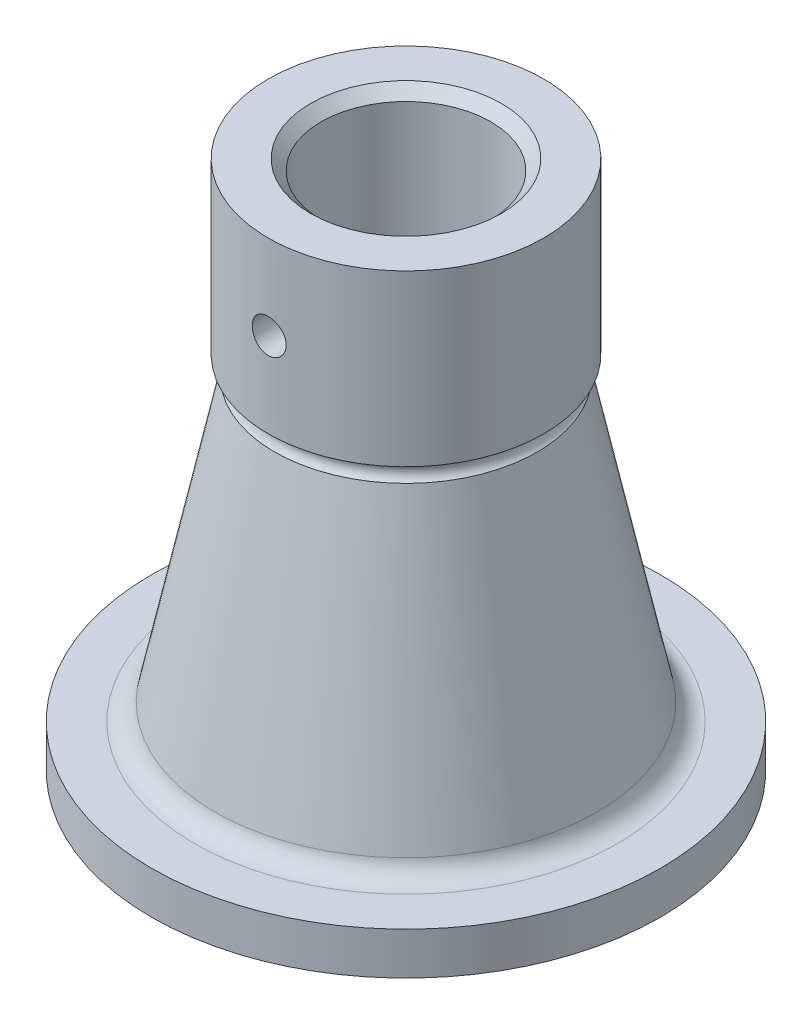
ISO-10303-21;
HEADER;
FILE_DESCRIPTION(('STEP AP214'),'2;1');
FILE_NAME('part.step','',(''),(''),'','','');
FILE_SCHEMA(('AUTOMOTIVE_DESIGN { 1 0 10303 214 1 1 1 1 }'));
ENDSEC;
DATA;
#1=APPLICATION_CONTEXT('core data for automotive mechanical design processes');
#2=APPLICATION_PROTOCOL_DEFINITION('international standard','automotive_design',2000,#1);
#3=PRODUCT_CONTEXT('',#1,'mechanical');
#4=PRODUCT('Part','Part','',(#3));
#5=PRODUCT_RELATED_PRODUCT_CATEGORY('part','',(#4));
#6=PRODUCT_DEFINITION_FORMATION('','',#4);
#7=PRODUCT_DEFINITION_CONTEXT('part definition',#1,'design');
#8=PRODUCT_DEFINITION('design','',#6,#7);
#9=PRODUCT_DEFINITION_SHAPE('','',#8);
#10=(LENGTH_UNIT() NAMED_UNIT(*) SI_UNIT(.MILLI.,.METRE.));
#11=(NAMED_UNIT(*) PLANE_ANGLE_UNIT() SI_UNIT($,.RADIAN.));
#12=(NAMED_UNIT(*) SI_UNIT($,.STERADIAN.) SOLID_ANGLE_UNIT());
#13=UNCERTAINTY_MEASURE_WITH_UNIT(LENGTH_MEASURE(1.E-05),#10,'distance_accuracy_value','');
#14=(GEOMETRIC_REPRESENTATION_CONTEXT(3) GLOBAL_UNCERTAINTY_ASSIGNED_CONTEXT((#13)) GLOBAL_UNIT_ASSIGNED_CONTEXT((#10,
#11,#12)) REPRESENTATION_CONTEXT('',''));
#15=CARTESIAN_POINT('',(0.,0.,0.));
#16=DIRECTION('',(0.,0.,1.));
#17=DIRECTION('',(1.,0.,0.));
#18=AXIS2_PLACEMENT_3D('',#15,#16,#17);
#19=CARTESIAN_POINT('',(0.,107.637867538209,0.));
#20=DIRECTION('',(0.,1.,0.));
#21=DIRECTION('',(-1.,0.,0.));
#22=AXIS2_PLACEMENT_3D('',#19,#20,#21);
#23=CYLINDRICAL_SURFACE('',#22,40.);
#24=CARTESIAN_POINT('',(0.,245.,0.));
#25=DIRECTION('',(0.,-1.,0.));
#26=DIRECTION('',(1.,0.,0.));
#27=AXIS2_PLACEMENT_3D('',#24,#25,#26);
#28=CIRCLE('',#27,40.);
#29=CARTESIAN_POINT('',(40.,245.,0.));
#30=VERTEX_POINT('',#29);
#31=EDGE_CURVE('E46',#30,#30,#28,.F.);
#32=ORIENTED_EDGE('',*,*,#31,.T.);
#33=EDGE_LOOP('',(#32));
#34=FACE_BOUND('',#33,.T.);
#35=CARTESIAN_POINT('',(0.,170.,0.));
#36=DIRECTION('',(0.,1.,0.));
#37=DIRECTION('',(-1.,0.,0.));
#38=AXIS2_PLACEMENT_3D('',#35,#36,#37);
#39=CIRCLE('',#38,40.);
#40=CARTESIAN_POINT('',(-40.,170.,0.));
#41=VERTEX_POINT('',#40);
#42=EDGE_CURVE('E50',#41,#41,#39,.T.);
#43=ORIENTED_EDGE('',*,*,#42,.F.);
#44=EDGE_LOOP('',(#43));
#45=FACE_BOUND('',#44,.T.);
#46=CARTESIAN_POINT('',(-7.99999999999999,210.,39.1918358845309));
#47=CARTESIAN_POINT('',(-8.00000444680969,210.222332175633,39.1918334625397));
#48=CARTESIAN_POINT('',(-7.9907291584773,210.444608835908,39.1937313091331));
#49=CARTESIAN_POINT('',(-7.95371066865295,210.887621846161,39.2012611241478));
#50=CARTESIAN_POINT('',(-7.92596434485904,211.108357929349,39.2068937238825));
#51=CARTESIAN_POINT('',(-7.8521990828277,211.546742610162,39.2217334401668));
#52=CARTESIAN_POINT('',(-7.80617061879166,211.764389536872,39.2309424201119));
#53=CARTESIAN_POINT('',(-7.69618591324897,212.195022282824,39.2526669640112));
#54=CARTESIAN_POINT('',(-7.63222307243572,212.408006355115,39.2651837450381));
#55=CARTESIAN_POINT('',(-7.48697016044796,212.827449315103,39.2931385131023));
#56=CARTESIAN_POINT('',(-7.40570417536747,213.033916819824,39.3085724361382));
#57=CARTESIAN_POINT('',(-7.22636557967729,213.439299899145,39.3419363650496));
#58=CARTESIAN_POINT('',(-7.12828668786424,213.638212617271,39.3598673033238));
#59=CARTESIAN_POINT('',(-6.91610452763906,214.026973316344,39.397704240132));
#60=CARTESIAN_POINT('',(-6.80200908681324,214.21682566489,39.4176092725028));
#61=CARTESIAN_POINT('',(-6.55850211762379,214.586397629298,39.45885578746));
#62=CARTESIAN_POINT('',(-6.42908361306724,214.766112574465,39.4801979224));
#63=CARTESIAN_POINT('',(-6.15411905829394,215.116347564313,39.5239982537687));
#64=CARTESIAN_POINT('',(-6.00838917838241,215.286721972054,39.5464671767086));
#65=CARTESIAN_POINT('',(-5.7032350436913,215.614555847078,39.5916264198183));
#66=CARTESIAN_POINT('',(-5.543816830061,215.772020952324,39.6143166384428));
#67=CARTESIAN_POINT('',(-5.21222816318055,216.07312556909,39.6593075766281));
#68=CARTESIAN_POINT('',(-5.04005175958518,216.21675855666,39.6816081083725));
#69=CARTESIAN_POINT('',(-4.68423328108784,216.489077915367,39.7251817805114));
#70=CARTESIAN_POINT('',(-4.5005952584197,216.61776952349,39.7464552793466));
#71=CARTESIAN_POINT('',(-4.1213483020559,216.860438562806,39.7875757512423));
#72=CARTESIAN_POINT('',(-3.92564710480117,216.97427431918,39.8074082874116));
#73=CARTESIAN_POINT('',(-3.52513751300379,217.185026813966,39.8448723364328));
#74=CARTESIAN_POINT('',(-3.32032926224334,217.281943819374,39.8625038840172));
#75=CARTESIAN_POINT('',(-2.90305593566493,217.458119839894,39.8950630092));
#76=CARTESIAN_POINT('',(-2.69059124663515,217.53737974556,39.9099907231617));
#77=CARTESIAN_POINT('',(-2.25952656075929,217.677623826346,39.9367144918616));
#78=CARTESIAN_POINT('',(-2.04092677948935,217.738608642742,39.9485106564848));
#79=CARTESIAN_POINT('',(-1.60205405924745,217.841144220004,39.968500666972));
#80=CARTESIAN_POINT('',(-1.38183970161486,217.882937042686,39.9767392987482));
#81=CARTESIAN_POINT('',(-0.938658138719993,217.947896472355,39.9895991805319));
#82=CARTESIAN_POINT('',(-0.715691991200105,217.971070022967,39.9942217790381));
#83=CARTESIAN_POINT('',(-0.268533421487414,217.998629421218,39.9997236189696));
#84=CARTESIAN_POINT('',(-0.0443408810457301,218.003013424017,40.0006024928197));
#85=CARTESIAN_POINT('',(0.403603341337242,217.99295264511,39.9985908186422));
#86=CARTESIAN_POINT('',(0.62735502670002,217.978508010115,39.9957002999853));
#87=CARTESIAN_POINT('',(1.06956007208302,217.931252816206,39.9863007335844));
#88=CARTESIAN_POINT('',(1.28804328418387,217.898710480689,39.9798445416014));
#89=CARTESIAN_POINT('',(1.72152458521657,217.815693779263,39.9635260481262));
#90=CARTESIAN_POINT('',(1.93652143825459,217.765213193633,39.9536625652588));
#91=CARTESIAN_POINT('',(2.36138127795779,217.646731273147,39.9308042118727));
#92=CARTESIAN_POINT('',(2.57124595647659,217.578735799815,39.9178103890461));
#93=CARTESIAN_POINT('',(2.98455504865933,217.425699384449,39.8890381591941));
#94=CARTESIAN_POINT('',(3.18799704189115,217.340652103024,39.8732587168138));
#95=CARTESIAN_POINT('',(3.58822554317844,217.153581553164,39.8392422414482));
#96=CARTESIAN_POINT('',(3.78496396602226,217.051458041196,39.8209908249741));
#97=CARTESIAN_POINT('',(4.16916132193276,216.831333137226,39.7826013735344));
#98=CARTESIAN_POINT('',(4.35661991885613,216.713331170632,39.7624632703037));
#99=CARTESIAN_POINT('',(4.72102648822366,216.462265047702,39.7208452652347));
#100=CARTESIAN_POINT('',(4.89797361761498,216.329199685713,39.6993652560542));
#101=CARTESIAN_POINT('',(5.24018167605238,216.048918395866,39.6556459734978));
#102=CARTESIAN_POINT('',(5.4054424697869,215.90170230421,39.633406691335));
#103=CARTESIAN_POINT('',(5.7259697449262,215.591412024096,39.5883811586584));
#104=CARTESIAN_POINT('',(5.88101130801579,215.428105806768,39.5655921383058));
#105=CARTESIAN_POINT('',(6.17680825803357,215.088974934227,39.5204937891078));
#106=CARTESIAN_POINT('',(6.31756390613738,214.913150507972,39.4981844514987));
#107=CARTESIAN_POINT('',(6.58384395745569,214.550129850313,39.4546728448073));
#108=CARTESIAN_POINT('',(6.70936487275157,214.362931029461,39.4334708298717));
#109=CARTESIAN_POINT('',(6.94419699330226,213.978546560124,39.3927954039874));
#110=CARTESIAN_POINT('',(7.05351435373699,213.781364742225,39.3733213377838));
#111=CARTESIAN_POINT('',(7.2554491579051,213.37779467369,39.3366117286613));
#112=CARTESIAN_POINT('',(7.34802357467671,213.171384356556,39.3193819842128));
#113=CARTESIAN_POINT('',(7.5153938362461,212.75135342897,39.287734887423));
#114=CARTESIAN_POINT('',(7.59019612345057,212.537735463463,39.2733165162983));
#115=CARTESIAN_POINT('',(7.72148193065288,212.104733186694,39.2477157945947));
#116=CARTESIAN_POINT('',(7.77796404897822,211.885348435605,39.2365336916291));
#117=CARTESIAN_POINT('',(7.87214359315173,211.442433226376,39.2177468212383));
#118=CARTESIAN_POINT('',(7.90984132146432,211.21890283505,39.2101419962123));
#119=CARTESIAN_POINT('',(7.96565933677234,210.773205053852,39.1988401365669));
#120=CARTESIAN_POINT('',(7.98410375513831,210.551079849913,39.1950784266016));
#121=CARTESIAN_POINT('',(8.0023968461039,210.106033935144,39.1913476849508));
#122=CARTESIAN_POINT('',(8.0022457037312,209.883113232251,39.1913786155281));
#123=CARTESIAN_POINT('',(7.98334963144251,209.438107142142,39.1952321147503));
#124=CARTESIAN_POINT('',(7.96460570341782,209.216021710563,39.1990544790899));
#125=CARTESIAN_POINT('',(7.9086774106627,208.774281003713,39.2103766066046));
#126=CARTESIAN_POINT('',(7.87149308532674,208.554625723251,39.2178763619237));
#127=CARTESIAN_POINT('',(7.77943482948001,208.121451877929,39.236240519964));
#128=CARTESIAN_POINT('',(7.72473759003574,207.907894292677,39.2470712742881));
#129=CARTESIAN_POINT('',(7.59795179367917,207.486110694725,39.2718130151192));
#130=CARTESIAN_POINT('',(7.52585730619399,207.277886526975,39.2857250518757));
#131=CARTESIAN_POINT('',(7.36484795633877,206.86832010563,39.3162271950907));
#132=CARTESIAN_POINT('',(7.27593785206036,206.66697592428,39.3328165437915));
#133=CARTESIAN_POINT('',(7.08189353673638,206.272381200041,39.3682169806381));
#134=CARTESIAN_POINT('',(6.9767535836758,206.079133552539,39.3870288545441));
#135=CARTESIAN_POINT('',(6.74955710289023,205.699649815831,39.4266019269176));
#136=CARTESIAN_POINT('',(6.62730047099554,205.513535808138,39.4473850769299));
#137=CARTESIAN_POINT('',(6.36777572580051,205.152226427614,39.4901091488608));
#138=CARTESIAN_POINT('',(6.23050740449846,204.977031206126,39.5120500868195));
#139=CARTESIAN_POINT('',(5.94185978392724,204.63867887915,39.5564864944536));
#140=CARTESIAN_POINT('',(5.79047699910404,204.475524765119,39.5789821000894));
#141=CARTESIAN_POINT('',(5.47469375684462,204.162436340226,39.6238961799815));
#142=CARTESIAN_POINT('',(5.31029738509048,204.012497911231,39.6463146761582));
#143=CARTESIAN_POINT('',(4.96688279801155,203.724566902598,39.6908114021731));
#144=CARTESIAN_POINT('',(4.78767697548576,203.58679631717,39.7128789212228));
#145=CARTESIAN_POINT('',(4.41814700095321,203.32684418468,39.7556859639914));
#146=CARTESIAN_POINT('',(4.2278229667403,203.204662472502,39.7764255017748));
#147=CARTESIAN_POINT('',(3.83736479359664,202.976772247741,39.8159908860154));
#148=CARTESIAN_POINT('',(3.6372307047351,202.871063651093,39.8348167422381));
#149=CARTESIAN_POINT('',(3.22855396209367,202.67691223777,39.8700200050484));
#150=CARTESIAN_POINT('',(3.020011582717,202.588468858196,39.8863974914561));
#151=CARTESIAN_POINT('',(2.59717074315931,202.429966994446,39.9161542481918));
#152=CARTESIAN_POINT('',(2.38291066058595,202.359809181703,39.9295496568498));
#153=CARTESIAN_POINT('',(1.94914589745062,202.237811586959,39.9530722705058));
#154=CARTESIAN_POINT('',(1.72964320206958,202.185964985013,39.9632006921592));
#155=CARTESIAN_POINT('',(1.2868937494974,202.10096705165,39.979907233652));
#156=CARTESIAN_POINT('',(1.06364667709733,202.067817302387,39.9864850530324));
#157=CARTESIAN_POINT('',(0.61507295002293,202.020492013919,39.995899885238));
#158=CARTESIAN_POINT('',(0.389746323146851,202.006316221449,39.9987369479946));
#159=CARTESIAN_POINT('',(-0.0573422421836458,201.997136550735,40.0005725685462));
#160=CARTESIAN_POINT('',(-0.279097141768111,202.001799722537,39.9996377882729));
#161=CARTESIAN_POINT('',(-0.721486558729135,202.029517418076,39.9941046686454));
#162=CARTESIAN_POINT('',(-0.94212065988317,202.052578333851,39.9895050559971));
#163=CARTESIAN_POINT('',(-1.38056597737012,202.116909141691,39.9767698778396));
#164=CARTESIAN_POINT('',(-1.59837777156444,202.158175243643,39.9686350483274));
#165=CARTESIAN_POINT('',(-2.02969087993135,202.258592811087,39.9490545945851));
#166=CARTESIAN_POINT('',(-2.24319208596191,202.317744724696,39.9376088874035));
#167=CARTESIAN_POINT('',(-2.66390281610609,202.453321633072,39.9117519105193));
#168=CARTESIAN_POINT('',(-2.87112575977152,202.52970632858,39.8973475665856));
#169=CARTESIAN_POINT('',(-3.27838682247712,202.699257993417,39.8659490992444));
#170=CARTESIAN_POINT('',(-3.47842481273432,202.792425263377,39.8489549294454));
#171=CARTESIAN_POINT('',(-3.86995196753947,202.994856534396,39.8128386654258));
#172=CARTESIAN_POINT('',(-4.06144207197444,203.104118760018,39.793716805968));
#173=CARTESIAN_POINT('',(-4.43469676676204,203.338019135688,39.7538515091122));
#174=CARTESIAN_POINT('',(-4.61645813066298,203.462662341957,39.7331075392999));
#175=CARTESIAN_POINT('',(-4.97182275164245,203.728556214626,39.6902194995578));
#176=CARTESIAN_POINT('',(-5.14524924859911,203.870040420248,39.6680583543292));
#177=CARTESIAN_POINT('',(-5.47961055337561,204.167001994422,39.6232548785426));
#178=CARTESIAN_POINT('',(-5.64054523476049,204.322479504572,39.6006125431173));
#179=CARTESIAN_POINT('',(-5.94890319793123,204.646442350761,39.5554654612822));
#180=CARTESIAN_POINT('',(-6.09632095041953,204.814932958535,39.5329607746618));
#181=CARTESIAN_POINT('',(-6.37651738391802,205.163674728468,39.4887343722211));
#182=CARTESIAN_POINT('',(-6.50930113051802,205.3439217865,39.4670123872305));
#183=CARTESIAN_POINT('',(-6.76076328463173,205.717096359114,39.4247197054883));
#184=CARTESIAN_POINT('',(-6.87926764553853,205.910142985973,39.4041645714432));
#185=CARTESIAN_POINT('',(-7.09951821043142,206.305671379204,39.3650778141222));
#186=CARTESIAN_POINT('',(-7.20127058692976,206.508149634916,39.3465454463808));
#187=CARTESIAN_POINT('',(-7.38724870626152,206.921073784938,39.3120529699356));
#188=CARTESIAN_POINT('',(-7.47148513122489,207.131514730078,39.2960912948383));
#189=CARTESIAN_POINT('',(-7.6218355672019,207.558902396914,39.2672059266167));
#190=CARTESIAN_POINT('',(-7.68795308442214,207.77584785089,39.2542816457923));
#191=CARTESIAN_POINT('',(-7.8292946733984,208.321948301562,39.2263906298774));
#192=CARTESIAN_POINT('',(-7.89322138931692,208.654204722914,39.2135042282173));
#193=CARTESIAN_POINT('',(-7.97856994221239,209.324350266896,39.1962288417274));
#194=CARTESIAN_POINT('',(-7.99999324453143,209.662239194936,39.1918395639519));
#195=CARTESIAN_POINT('',(-7.99999999999999,210.,39.1918358845309));
#196=B_SPLINE_CURVE_WITH_KNOTS('',3,(#46,#47,#48,#49,#50,#51,#52,#53,#54,#55,#56,#57,#58,#59,
#60,#61,#62,#63,#64,#65,#66,#67,#68,#69,#70,#71,#72,#73,#74,#75,#76,#77,#78,#79,#80,#81,#82,#83,
#84,#85,#86,#87,#88,#89,#90,#91,#92,#93,#94,#95,#96,#97,#98,#99,#100,#101,#102,#103,#104,#105,
#106,#107,#108,#109,#110,#111,#112,#113,#114,#115,#116,#117,#118,#119,#120,#121,#122,#123,#124,
#125,#126,#127,#128,#129,#130,#131,#132,#133,#134,#135,#136,#137,#138,#139,#140,#141,#142,#143,
#144,#145,#146,#147,#148,#149,#150,#151,#152,#153,#154,#155,#156,#157,#158,#159,#160,#161,#162,
#163,#164,#165,#166,#167,#168,#169,#170,#171,#172,#173,#174,#175,#176,#177,#178,#179,#180,#181,
#182,#183,#184,#185,#186,#187,#188,#189,#190,#191,#192,#193,#194,#195),.UNSPECIFIED.,.T.,.F.,(4,
2,2,2,2,2,2,2,2,2,2,2,2,2,2,2,2,2,2,2,2,2,2,2,2,2,2,2,2,2,2,2,2,2,2,2,2,2,2,2,2,2,2,2,2,2,2,2,2,
2,2,2,2,2,2,2,2,2,2,2,2,2,2,2,2,2,2,2,2,2,2,2,2,2,4),(0.,0.666699620809206,1.33351196763624,
2.00067220974089,2.6680782694827,3.33456129926917,4.00129386803289,4.66770171927309,
5.33441414385647,6.00958778201576,6.6844649586951,7.35965889967108,8.03461546466404,
8.71559997574724,9.39657373925776,10.0775131494083,10.758428662454,11.4305027443343,
12.1023260753042,12.7742153672942,13.4460994240273,14.1082812048318,14.7706928080069,
15.4328830161807,16.0953198663875,16.7617915394051,17.4282873364011,18.094836516492,
18.7613934130349,19.4395899828793,20.1177741516753,20.7961132957513,21.4741940978061,
22.1539934485735,22.8335459944277,23.5131505204549,24.1927441032028,24.8607025024088,
25.5286542553628,26.196570017008,26.8644843517821,27.5258617659393,28.1874649572828,
28.8488812228827,29.5105320318643,30.1806891108883,30.8508554767743,31.5211877802067,
32.1913104577717,32.8718527668964,33.5523878672035,34.2329194945117,34.9134289307253,
35.5901608876029,36.2666405316387,36.9431774117519,37.6197052613858,38.284329287513,
38.9491843285899,39.6139010197189,40.2786343662832,40.9418290420189,41.605035598918,
42.2681690520739,42.9315210820593,43.6054724763123,44.2794306910234,44.9536633795958,
45.6276619432675,46.3091860184527,46.9904584114241,47.671314102898,48.3520379481715,
49.3649042320086,50.3777355957941),.UNSPECIFIED.);
#197=CARTESIAN_POINT('',(-7.99999999999999,210.,39.1918358845309));
#198=VERTEX_POINT('',#197);
#199=EDGE_CURVE('E82',#198,#198,#196,.T.);
#200=ORIENTED_EDGE('',*,*,#199,.F.);
#201=EDGE_LOOP('',(#200));
#202=FACE_BOUND('',#201,.T.);
#203=ADVANCED_FACE('F32',(#34,#45,#202),#23,.F.);
#204=CARTESIAN_POINT('',(0.,107.637867538209,0.));
#205=DIRECTION('',(0.,1.,0.));
#206=DIRECTION('',(-1.,0.,0.));
#207=AXIS2_PLACEMENT_3D('',#204,#205,#206);
#208=CYLINDRICAL_SURFACE('',#207,65.);
#209=CARTESIAN_POINT('',(0.,250.,0.));
#210=DIRECTION('',(0.,1.,0.));
#211=DIRECTION('',(-1.,0.,0.));
#212=AXIS2_PLACEMENT_3D('',#209,#210,#211);
#213=CIRCLE('',#212,65.);
#214=CARTESIAN_POINT('',(-65.,250.,0.));
#215=VERTEX_POINT('',#214);
#216=EDGE_CURVE('E79',#215,#215,#213,.T.);
#217=ORIENTED_EDGE('',*,*,#216,.F.);
#218=EDGE_LOOP('',(#217));
#219=FACE_BOUND('',#218,.T.);
#220=CARTESIAN_POINT('',(0.,170.,0.));
#221=DIRECTION('',(0.,1.,0.));
#222=DIRECTION('',(-1.,0.,0.));
#223=AXIS2_PLACEMENT_3D('',#220,#221,#222);
#224=CIRCLE('',#223,65.);
#225=CARTESIAN_POINT('',(-65.,170.,0.));
#226=VERTEX_POINT('',#225);
#227=EDGE_CURVE('E76',#226,#226,#224,.T.);
#228=ORIENTED_EDGE('',*,*,#227,.T.);
#229=EDGE_LOOP('',(#228));
#230=FACE_BOUND('',#229,.T.);
#231=CARTESIAN_POINT('',(-7.99999999999999,210.,64.5058136914806));
#232=CARTESIAN_POINT('',(-8.0000025380444,209.776154542913,64.5058128296191));
#233=CARTESIAN_POINT('',(-7.99060160219574,209.552346448496,64.5069812184724));
#234=CARTESIAN_POINT('',(-7.95306991204887,209.106259261952,64.5116195283139));
#235=CARTESIAN_POINT('',(-7.92493489043983,208.883980529847,64.5150899736711));
#236=CARTESIAN_POINT('',(-7.85010930880634,208.44244872097,64.5242372893807));
#237=CARTESIAN_POINT('',(-7.80340483807146,208.223198040265,64.5299158137746));
#238=CARTESIAN_POINT('',(-7.69176693413567,207.789365219805,64.5433178629049));
#239=CARTESIAN_POINT('',(-7.62682682299025,207.574784821397,64.5510421367416));
#240=CARTESIAN_POINT('',(-7.4792787864831,207.152116149779,64.5683041028243));
#241=CARTESIAN_POINT('',(-7.39668943041488,206.944021314572,64.5778398879635));
#242=CARTESIAN_POINT('',(-7.21436722359947,206.535470771162,64.5984622090374));
#243=CARTESIAN_POINT('',(-7.11462805862412,206.335017909915,64.6095493158576));
#244=CARTESIAN_POINT('',(-6.8987817489119,205.943301860186,64.6329527707257));
#245=CARTESIAN_POINT('',(-6.78268074721648,205.752035258702,64.6452686569245));
#246=CARTESIAN_POINT('',(-6.5349009694674,205.379931294164,64.6707860974151));
#247=CARTESIAN_POINT('',(-6.40322186281587,205.199094152567,64.6839876705003));
#248=CARTESIAN_POINT('',(-6.1245368160894,204.848254761147,64.7109707431457));
#249=CARTESIAN_POINT('',(-5.97745991832936,204.678309063486,64.724754735805));
#250=CARTESIAN_POINT('',(-5.66953618747561,204.351390953769,64.7524536126603));
#251=CARTESIAN_POINT('',(-5.50868898818672,204.19441888694,64.7663685003284));
#252=CARTESIAN_POINT('',(-5.17437211334279,203.894569170241,64.7939348555136));
#253=CARTESIAN_POINT('',(-5.0009041486817,203.751689616128,64.8075863584194));
#254=CARTESIAN_POINT('',(-4.64247197968532,203.480957609986,64.8342483125216));
#255=CARTESIAN_POINT('',(-4.45750381882709,203.353110373896,64.8472585403032));
#256=CARTESIAN_POINT('',(-4.07683779368492,203.113042659973,64.8723044158349));
#257=CARTESIAN_POINT('',(-3.88110906488818,203.000870793208,64.8843369854945));
#258=CARTESIAN_POINT('',(-3.48081438268114,202.793423199975,64.9070420932205));
#259=CARTESIAN_POINT('',(-3.27624832736465,202.698147668409,64.9177146155981));
#260=CARTESIAN_POINT('',(-2.85974007475215,202.525193496479,64.9373955894752));
#261=CARTESIAN_POINT('',(-2.64779819851939,202.447514091273,64.9464041132996));
#262=CARTESIAN_POINT('',(-2.21803849868823,202.310319617937,64.9625010211681));
#263=CARTESIAN_POINT('',(-2.00022057743389,202.250804851894,64.9695893732786));
#264=CARTESIAN_POINT('',(-1.56143678245944,202.150650400035,64.9816114607866));
#265=CARTESIAN_POINT('',(-1.34049351081566,202.109913019737,64.9865563399832));
#266=CARTESIAN_POINT('',(-0.895848209817034,202.047146100673,64.9942067586869));
#267=CARTESIAN_POINT('',(-0.672145253151825,202.025123034166,64.9969115234526));
#268=CARTESIAN_POINT('',(-0.223712246809657,201.999976673749,65.0000016681443));
#269=CARTESIAN_POINT('',(0.00101757005104477,201.996849289656,65.0003875500184));
#270=CARTESIAN_POINT('',(0.449939225868648,202.009507036428,64.998830285968));
#271=CARTESIAN_POINT('',(0.674131057380902,202.025292427514,64.996887107998));
#272=CARTESIAN_POINT('',(1.11914704367017,202.075520324863,64.9907436692789));
#273=CARTESIAN_POINT('',(1.33998288215267,202.109860906014,64.9865557401203));
#274=CARTESIAN_POINT('',(1.77796391814738,202.196879147419,64.9760481417298));
#275=CARTESIAN_POINT('',(1.99510904934285,202.249557136806,64.9697284342353));
#276=CARTESIAN_POINT('',(2.42413656078177,202.372853057286,64.9551354997355));
#277=CARTESIAN_POINT('',(2.63601983069475,202.443467932645,64.9468626054926));
#278=CARTESIAN_POINT('',(3.0531508783126,202.602156899865,64.9285905665876));
#279=CARTESIAN_POINT('',(3.25839632120177,202.690237058993,64.918590822191));
#280=CARTESIAN_POINT('',(3.66119964488199,202.883426194653,64.8971216008308));
#281=CARTESIAN_POINT('',(3.85873917186334,202.988573074381,64.8856488646578));
#282=CARTESIAN_POINT('',(4.24433941321721,203.215046333191,64.8615673577161));
#283=CARTESIAN_POINT('',(4.43239660553292,203.336378663971,64.8489581696083));
#284=CARTESIAN_POINT('',(4.79762527135179,203.594317752689,64.8229612895718));
#285=CARTESIAN_POINT('',(4.97479841633722,203.730922156135,64.8095737177985));
#286=CARTESIAN_POINT('',(5.31707139745298,204.018469053439,64.7823913716352));
#287=CARTESIAN_POINT('',(5.48217099076324,204.169411835527,64.7685965890633));
#288=CARTESIAN_POINT('',(5.80020335406504,204.485631959748,64.740893527873));
#289=CARTESIAN_POINT('',(5.95304843498557,204.650997503732,64.7269851020223));
#290=CARTESIAN_POINT('',(6.24427648489844,204.994039203273,64.6995394777565));
#291=CARTESIAN_POINT('',(6.38265904735563,205.171715704653,64.6860022897845));
#292=CARTESIAN_POINT('',(6.64396118757814,205.538119320212,64.6596863334581));
#293=CARTESIAN_POINT('',(6.76688357369824,205.72684441825,64.6469074275844));
#294=CARTESIAN_POINT('',(6.9964371836266,206.114050129345,64.6224663688091));
#295=CARTESIAN_POINT('',(7.10306269184082,206.312534132908,64.6108046082422));
#296=CARTESIAN_POINT('',(7.39725639121362,206.92055960408,64.5780138358262));
#297=CARTESIAN_POINT('',(7.55931684149317,207.342920463284,64.5590609980475));
#298=CARTESIAN_POINT('',(7.81000682906683,208.209171049307,64.5292184476067));
#299=CARTESIAN_POINT('',(7.89863979353107,208.653059770307,64.5183283586245));
#300=CARTESIAN_POINT('',(7.97451057067843,209.323556384359,64.508972464199));
#301=CARTESIAN_POINT('',(7.99032197135585,209.547209201161,64.5070129232729));
#302=CARTESIAN_POINT('',(8.00312862545445,209.995037521893,64.5054265465535));
#303=CARTESIAN_POINT('',(8.00013060021617,210.219212810501,64.5057988774915));
#304=CARTESIAN_POINT('',(7.97533381998694,210.666527878603,64.5088690365323));
#305=CARTESIAN_POINT('',(7.95353191129968,210.889667478084,64.5115672547215));
#306=CARTESIAN_POINT('',(7.89129222903351,211.333291802311,64.5192102674024));
#307=CARTESIAN_POINT('',(7.85085487288643,211.55377658641,64.5241550115721));
#308=CARTESIAN_POINT('',(7.75180511183149,211.989809438042,64.5361293576468));
#309=CARTESIAN_POINT('',(7.69325231008229,212.205371241382,64.5431521192348));
#310=CARTESIAN_POINT('',(7.55835867262341,212.630780372477,64.5590878398149));
#311=CARTESIAN_POINT('',(7.48201803782887,212.840627764747,64.5680007774572));
#312=CARTESIAN_POINT('',(7.31208328475592,213.25318598851,64.5874658753705));
#313=CARTESIAN_POINT('',(7.21848569787255,213.455895375509,64.5980183651202));
#314=CARTESIAN_POINT('',(7.01475086176413,213.85265968296,64.620459326913));
#315=CARTESIAN_POINT('',(6.904619178942,214.046717487663,64.6323473489952));
#316=CARTESIAN_POINT('',(6.66794312588431,214.425918104509,64.6571941955928));
#317=CARTESIAN_POINT('',(6.54131476883957,214.611008149046,64.6701583672));
#318=CARTESIAN_POINT('',(6.27300048820777,214.969875134504,64.6967358696734));
#319=CARTESIAN_POINT('',(6.13131487536462,215.143652308775,64.7103491871397));
#320=CARTESIAN_POINT('',(5.83386630671942,215.478703328278,64.7378429184576));
#321=CARTESIAN_POINT('',(5.67810259770768,215.63997650366,64.751723346569));
#322=CARTESIAN_POINT('',(5.35358955865358,215.948887468588,64.7793608308321));
#323=CARTESIAN_POINT('',(5.18484040941621,216.096525447923,64.7931178886986));
#324=CARTESIAN_POINT('',(4.83452255180188,216.377943177555,64.8202007431792));
#325=CARTESIAN_POINT('',(4.65288597663829,216.511638742467,64.8335236196198));
#326=CARTESIAN_POINT('',(4.27900154377924,216.763201570301,64.8592725771402));
#327=CARTESIAN_POINT('',(4.08675763048369,216.881074661671,64.8716989876623));
#328=CARTESIAN_POINT('',(3.69287960509247,217.100243033337,64.8953124002442));
#329=CARTESIAN_POINT('',(3.49124224409172,217.201532522366,64.9064989688921));
#330=CARTESIAN_POINT('',(3.08013854651004,217.386714613996,64.927306161033));
#331=CARTESIAN_POINT('',(2.87067501161821,217.47061337319,64.9369273384388));
#332=CARTESIAN_POINT('',(2.44585981719795,217.620259951944,64.9543135429382));
#333=CARTESIAN_POINT('',(2.23052371637034,217.686051418061,64.9620830272533));
#334=CARTESIAN_POINT('',(1.79501711934119,217.799264884167,64.9755751822911));
#335=CARTESIAN_POINT('',(1.57484673515655,217.846687309318,64.9812979003871));
#336=CARTESIAN_POINT('',(1.13125071237746,217.922809721485,64.9905338040852));
#337=CARTESIAN_POINT('',(0.907825132165466,217.951510043864,64.994047029265));
#338=CARTESIAN_POINT('',(0.459329388578397,217.989973215747,64.9987638816335));
#339=CARTESIAN_POINT('',(0.234259258365656,217.999736446066,64.9999675552659));
#340=CARTESIAN_POINT('',(-0.214453397039919,218.0002513607,65.0000309439817));
#341=CARTESIAN_POINT('',(-0.438095789722673,217.991124969338,64.9989056912776));
#342=CARTESIAN_POINT('',(-0.883729330089251,217.954180871532,64.9943740517852));
#343=CARTESIAN_POINT('',(-1.10572102782745,217.926369702097,64.9909684627911));
#344=CARTESIAN_POINT('',(-1.54659284392531,217.852262403617,64.9819719176464));
#345=CARTESIAN_POINT('',(-1.76547239408688,217.805962942846,64.9763805676097));
#346=CARTESIAN_POINT('',(-2.19852477358543,217.695221736226,64.9631697104126));
#347=CARTESIAN_POINT('',(-2.41269769674933,217.630780352392,64.9555502437228));
#348=CARTESIAN_POINT('',(-2.83476632161152,217.484249299611,64.9384993558548));
#349=CARTESIAN_POINT('',(-3.04266401289684,217.402165292803,64.929068516113));
#350=CARTESIAN_POINT('',(-3.4507996891193,217.220930451621,64.90865685349));
#351=CARTESIAN_POINT('',(-3.65103775068611,217.121779788043,64.8976760461204));
#352=CARTESIAN_POINT('',(-4.04250204375627,216.907099191869,64.8744682897126));
#353=CARTESIAN_POINT('',(-4.23372666746315,216.791566351679,64.8622411195721));
#354=CARTESIAN_POINT('',(-4.60574315741446,216.544991420862,64.8368867619049));
#355=CARTESIAN_POINT('',(-4.78653851059588,216.413954559104,64.8237598784392));
#356=CARTESIAN_POINT('',(-5.13766835218156,216.136349033385,64.7968793714253));
#357=CARTESIAN_POINT('',(-5.30792674728838,215.989684453916,64.7831222123589));
#358=CARTESIAN_POINT('',(-5.63549697515533,215.682567994993,64.7554491755932));
#359=CARTESIAN_POINT('',(-5.79280905679289,215.5221163807,64.7415333009509));
#360=CARTESIAN_POINT('',(-6.09343172373807,215.18849891957,64.7139311651158));
#361=CARTESIAN_POINT('',(-6.23673870464554,215.015329819696,64.7002449637794));
#362=CARTESIAN_POINT('',(-6.5082964844596,214.657522811688,64.6734930128127));
#363=CARTESIAN_POINT('',(-6.63654753132508,214.472885092508,64.6604272529665));
#364=CARTESIAN_POINT('',(-6.877563445931,214.092674157784,64.6352370393073));
#365=CARTESIAN_POINT('',(-6.99026513638837,213.897060624486,64.6231165078814));
#366=CARTESIAN_POINT('',(-7.19872807216917,213.49702293825,64.6002268621546));
#367=CARTESIAN_POINT('',(-7.29449553169507,213.292602051657,64.5894572525414));
#368=CARTESIAN_POINT('',(-7.46837395946528,212.876489002142,64.5695830209758));
#369=CARTESIAN_POINT('',(-7.54649877422781,212.664802692741,64.5604770943905));
#370=CARTESIAN_POINT('',(-7.68459233127148,212.235591549597,64.5441853456082));
#371=CARTESIAN_POINT('',(-7.74456537381991,212.018068112021,64.5369990686818));
#372=CARTESIAN_POINT('',(-7.8631808895762,211.503878825644,64.5226716360611));
#373=CARTESIAN_POINT('',(-7.91443550609573,211.205454479268,64.5163768572735));
#374=CARTESIAN_POINT('',(-7.98284322361904,210.604664022321,64.5079484820641));
#375=CARTESIAN_POINT('',(-7.99999657243168,210.30229794041,64.5058148554039));
#376=CARTESIAN_POINT('',(-7.99999999999999,210.,64.5058136914806));
#377=B_SPLINE_CURVE_WITH_KNOTS('',3,(#231,#232,#233,#234,#235,#236,#237,#238,#239,#240,#241,
#242,#243,#244,#245,#246,#247,#248,#249,#250,#251,#252,#253,#254,#255,#256,#257,#258,#259,#260,
#261,#262,#263,#264,#265,#266,#267,#268,#269,#270,#271,#272,#273,#274,#275,#276,#277,#278,#279,
#280,#281,#282,#283,#284,#285,#286,#287,#288,#289,#290,#291,#292,#293,#294,#295,#296,#297,#298,
#299,#300,#301,#302,#303,#304,#305,#306,#307,#308,#309,#310,#311,#312,#313,#314,#315,#316,#317,
#318,#319,#320,#321,#322,#323,#324,#325,#326,#327,#328,#329,#330,#331,#332,#333,#334,#335,#336,
#337,#338,#339,#340,#341,#342,#343,#344,#345,#346,#347,#348,#349,#350,#351,#352,#353,#354,#355,
#356,#357,#358,#359,#360,#361,#362,#363,#364,#365,#366,#367,#368,#369,#370,#371,#372,#373,#374,
#375,#376),.UNSPECIFIED.,.T.,.F.,(4,2,2,2,2,2,2,2,2,2,2,2,2,2,2,2,2,2,2,2,2,2,2,2,2,2,2,2,2,2,2,
2,2,2,2,2,2,2,2,2,2,2,2,2,2,2,2,2,2,2,2,2,2,2,2,2,2,2,2,2,2,2,2,2,2,2,2,2,2,2,2,2,4),(0.,
0.671271805593312,1.34269656798648,2.01462525736372,2.68680033059294,3.35827164014129,
4.02999070389548,4.70145823972079,5.37294002795786,6.04766512140857,6.72240816347674,
7.39705990596892,8.07194505370327,8.74887873401156,9.42582022235426,10.1027322807733,
10.7796555959586,11.4530161359489,12.1266094598864,12.8000569717504,13.4735137496593,
14.1433082368041,14.813114746503,15.4828072242067,16.1527327553375,16.8241669989638,
17.495848825869,18.1674272422127,18.8390191614517,19.5150527753325,20.1911053871186,
20.8670350154326,21.5432011625413,22.894637725886,24.2460112084382,24.9180006628932,
25.5897500030216,26.2616120276107,26.9334590033007,27.6031185727025,28.2727705786073,
28.9425573299448,29.6121190930612,30.2852336254334,30.9583342691102,31.631470946522,
32.3045982530966,32.9815795640221,33.658310810232,34.3352778804114,35.0120048827616,
35.6870860964412,36.362151684046,37.0372051791117,37.7122450990936,38.3829415192041,
39.0534034132643,39.7239861839978,40.3945555744718,41.0649100761305,41.7352578695684,
42.40572478907,43.0759662287427,43.7505882428641,44.4251972851517,45.0999794923938,
45.7747505849668,46.4521872621335,47.1293748282153,47.8060290540752,48.4825228506552,
49.3890659700142,50.2956025016345),.UNSPECIFIED.);
#378=CARTESIAN_POINT('',(-7.99999999999999,210.,64.5058136914806));
#379=VERTEX_POINT('',#378);
#380=EDGE_CURVE('E37',#379,#379,#377,.T.);
#381=ORIENTED_EDGE('',*,*,#380,.F.);
#382=EDGE_LOOP('',(#381));
#383=FACE_BOUND('',#382,.T.);
#384=ADVANCED_FACE('F98',(#219,#230,#383),#208,.T.);
#385=CARTESIAN_POINT('',(0.,165.001156258574,0.));
#386=DIRECTION('',(0.,1.,0.));
#387=DIRECTION('',(-1.,0.,0.));
#388=AXIS2_PLACEMENT_3D('',#385,#386,#387);
#389=TOROIDAL_SURFACE('',#388,40.1075232477699,4.99999999999998);
#390=CARTESIAN_POINT('',(0.,166.032500637959,0.));
#391=DIRECTION('',(0.,1.,0.));
#392=DIRECTION('',(-1.,0.,0.));
#393=AXIS2_PLACEMENT_3D('',#390,#391,#392);
#394=CIRCLE('',#393,45.);
#395=CARTESIAN_POINT('',(-45.,166.032500637959,0.));
#396=VERTEX_POINT('',#395);
#397=EDGE_CURVE('E55',#396,#396,#394,.T.);
#398=ORIENTED_EDGE('',*,*,#397,.F.);
#399=EDGE_LOOP('',(#398));
#400=FACE_BOUND('',#399,.T.);
#401=ORIENTED_EDGE('',*,*,#42,.T.);
#402=EDGE_LOOP('',(#401));
#403=FACE_BOUND('',#402,.T.);
#404=ADVANCED_FACE('F102',(#400,#403),#389,.F.);
#405=CARTESIAN_POINT('',(0.,166.032500637959,0.));
#406=DIRECTION('',(0.,-1.,0.));
#407=DIRECTION('',(1.,0.,0.));
#408=AXIS2_PLACEMENT_3D('',#405,#406,#407);
#409=CONICAL_SURFACE('',#408,45.,0.207760292726583);
#410=CARTESIAN_POINT('',(0.,0.,0.));
#411=DIRECTION('',(0.,1.,0.));
#412=DIRECTION('',(-1.,0.,0.));
#413=AXIS2_PLACEMENT_3D('',#410,#411,#412);
#414=CIRCLE('',#413,80.);
#415=CARTESIAN_POINT('',(-80.,0.,0.));
#416=VERTEX_POINT('',#415);
#417=EDGE_CURVE('E58',#416,#416,#414,.T.);
#418=ORIENTED_EDGE('',*,*,#417,.F.);
#419=EDGE_LOOP('',(#418));
#420=FACE_BOUND('',#419,.T.);
#421=ORIENTED_EDGE('',*,*,#397,.T.);
#422=EDGE_LOOP('',(#421));
#423=FACE_BOUND('',#422,.T.);
#424=ADVANCED_FACE('F126',(#420,#423),#409,.F.);
#425=CARTESIAN_POINT('',(120.,0.,0.));
#426=DIRECTION('',(0.,1.,0.));
#427=DIRECTION('',(-1.,0.,0.));
#428=AXIS2_PLACEMENT_3D('',#425,#426,#427);
#429=PLANE('',#428);
#430=CARTESIAN_POINT('',(0.,0.,0.));
#431=DIRECTION('',(0.,1.,0.));
#432=DIRECTION('',(-1.,0.,0.));
#433=AXIS2_PLACEMENT_3D('',#430,#431,#432);
#434=CIRCLE('',#433,120.);
#435=CARTESIAN_POINT('',(-120.,0.,0.));
#436=VERTEX_POINT('',#435);
#437=EDGE_CURVE('E61',#436,#436,#434,.T.);
#438=ORIENTED_EDGE('',*,*,#437,.F.);
#439=EDGE_LOOP('',(#438));
#440=FACE_BOUND('',#439,.T.);
#441=ORIENTED_EDGE('',*,*,#417,.T.);
#442=EDGE_LOOP('',(#441));
#443=FACE_BOUND('',#442,.T.);
#444=ADVANCED_FACE('F122',(#440,#443),#429,.F.);
#445=CARTESIAN_POINT('',(0.,107.637867538209,0.));
#446=DIRECTION('',(0.,1.,0.));
#447=DIRECTION('',(-1.,0.,0.));
#448=AXIS2_PLACEMENT_3D('',#445,#446,#447);
#449=CYLINDRICAL_SURFACE('',#448,120.);
#450=CARTESIAN_POINT('',(0.,20.,0.));
#451=DIRECTION('',(0.,1.,0.));
#452=DIRECTION('',(-1.,0.,0.));
#453=AXIS2_PLACEMENT_3D('',#450,#451,#452);
#454=CIRCLE('',#453,120.);
#455=CARTESIAN_POINT('',(-120.,20.,0.));
#456=VERTEX_POINT('',#455);
#457=EDGE_CURVE('E64',#456,#456,#454,.T.);
#458=ORIENTED_EDGE('',*,*,#457,.F.);
#459=EDGE_LOOP('',(#458));
#460=FACE_BOUND('',#459,.T.);
#461=ORIENTED_EDGE('',*,*,#437,.T.);
#462=EDGE_LOOP('',(#461));
#463=FACE_BOUND('',#462,.T.);
#464=ADVANCED_FACE('F118',(#460,#463),#449,.T.);
#465=CARTESIAN_POINT('',(99.7849535044603,20.,0.));
#466=DIRECTION('',(0.,-1.,0.));
#467=DIRECTION('',(1.,0.,0.));
#468=AXIS2_PLACEMENT_3D('',#465,#466,#467);
#469=PLANE('',#468);
#470=CARTESIAN_POINT('',(0.,20.,0.));
#471=DIRECTION('',(0.,1.,0.));
#472=DIRECTION('',(-1.,0.,0.));
#473=AXIS2_PLACEMENT_3D('',#470,#471,#472);
#474=CIRCLE('',#473,99.7849535044603);
#475=CARTESIAN_POINT('',(-99.7849535044603,20.,0.));
#476=VERTEX_POINT('',#475);
#477=EDGE_CURVE('E67',#476,#476,#474,.T.);
#478=ORIENTED_EDGE('',*,*,#477,.F.);
#479=EDGE_LOOP('',(#478));
#480=FACE_BOUND('',#479,.T.);
#481=ORIENTED_EDGE('',*,*,#457,.T.);
#482=EDGE_LOOP('',(#481));
#483=FACE_BOUND('',#482,.T.);
#484=ADVANCED_FACE('F114',(#480,#483),#469,.F.);
#485=CARTESIAN_POINT('',(0.,30.,0.));
#486=DIRECTION('',(0.,1.,0.));
#487=DIRECTION('',(-1.,0.,0.));
#488=AXIS2_PLACEMENT_3D('',#485,#486,#487);
#489=TOROIDAL_SURFACE('',#488,99.7849535044603,10.);
#490=CARTESIAN_POINT('',(0.,27.9373112412317,0.));
#491=DIRECTION('',(0.,1.,0.));
#492=DIRECTION('',(-1.,0.,0.));
#493=AXIS2_PLACEMENT_3D('',#490,#491,#492);
#494=CIRCLE('',#493,90.);
#495=CARTESIAN_POINT('',(-90.,27.9373112412317,0.));
#496=VERTEX_POINT('',#495);
#497=EDGE_CURVE('E70',#496,#496,#494,.T.);
#498=ORIENTED_EDGE('',*,*,#497,.F.);
#499=EDGE_LOOP('',(#498));
#500=FACE_BOUND('',#499,.T.);
#501=ORIENTED_EDGE('',*,*,#477,.T.);
#502=EDGE_LOOP('',(#501));
#503=FACE_BOUND('',#502,.T.);
#504=ADVANCED_FACE('F110',(#500,#503),#489,.F.);
#505=CARTESIAN_POINT('',(0.,27.9373112412317,0.));
#506=DIRECTION('',(0.,-1.,0.));
#507=DIRECTION('',(1.,0.,0.));
#508=AXIS2_PLACEMENT_3D('',#505,#506,#507);
#509=CONICAL_SURFACE('',#508,90.,0.207760292726583);
#510=CARTESIAN_POINT('',(0.,161.045277028184,0.));
#511=DIRECTION('',(0.,1.,0.));
#512=DIRECTION('',(-1.,0.,0.));
#513=AXIS2_PLACEMENT_3D('',#510,#511,#512);
#514=CIRCLE('',#513,61.9405611272336);
#515=CARTESIAN_POINT('',(-61.9405611272336,161.045277028184,0.));
#516=VERTEX_POINT('',#515);
#517=EDGE_CURVE('E73',#516,#516,#514,.T.);
#518=ORIENTED_EDGE('',*,*,#517,.F.);
#519=EDGE_LOOP('',(#518));
#520=FACE_BOUND('',#519,.T.);
#521=ORIENTED_EDGE('',*,*,#497,.T.);
#522=EDGE_LOOP('',(#521));
#523=FACE_BOUND('',#522,.T.);
#524=ADVANCED_FACE('F106',(#520,#523),#509,.T.);
#525=CARTESIAN_POINT('',(0.,165.,0.));
#526=DIRECTION('',(0.,1.,0.));
#527=DIRECTION('',(-1.,0.,0.));
#528=AXIS2_PLACEMENT_3D('',#525,#526,#527);
#529=TOROIDAL_SURFACE('',#528,65.,5.);
#530=ORIENTED_EDGE('',*,*,#227,.F.);
#531=EDGE_LOOP('',(#530));
#532=FACE_BOUND('',#531,.T.);
#533=ORIENTED_EDGE('',*,*,#517,.T.);
#534=EDGE_LOOP('',(#533));
#535=FACE_BOUND('',#534,.T.);
#536=ADVANCED_FACE('F97',(#532,#535),#529,.F.);
#537=CARTESIAN_POINT('',(40.,250.,0.));
#538=DIRECTION('',(0.,-1.,0.));
#539=DIRECTION('',(1.,0.,0.));
#540=AXIS2_PLACEMENT_3D('',#537,#538,#539);
#541=PLANE('',#540);
#542=CARTESIAN_POINT('',(0.,250.,0.));
#543=DIRECTION('',(0.,-1.,0.));
#544=DIRECTION('',(1.,0.,0.));
#545=AXIS2_PLACEMENT_3D('',#542,#543,#544);
#546=CIRCLE('',#545,45.0000000000001);
#547=CARTESIAN_POINT('',(45.0000000000001,250.,0.));
#548=VERTEX_POINT('',#547);
#549=EDGE_CURVE('E10',#548,#548,#546,.T.);
#550=ORIENTED_EDGE('',*,*,#549,.T.);
#551=EDGE_LOOP('',(#550));
#552=FACE_BOUND('',#551,.T.);
#553=ORIENTED_EDGE('',*,*,#216,.T.);
#554=EDGE_LOOP('',(#553));
#555=FACE_BOUND('',#554,.T.);
#556=ADVANCED_FACE('F94',(#552,#555),#541,.F.);
#557=CARTESIAN_POINT('',(0.,245.,0.));
#558=DIRECTION('',(0.,1.,0.));
#559=DIRECTION('',(-1.,0.,0.));
#560=AXIS2_PLACEMENT_3D('',#557,#558,#559);
#561=CONICAL_SURFACE('',#560,40.,0.78539816339745);
#562=ORIENTED_EDGE('',*,*,#549,.F.);
#563=EDGE_LOOP('',(#562));
#564=FACE_BOUND('',#563,.T.);
#565=ORIENTED_EDGE('',*,*,#31,.F.);
#566=EDGE_LOOP('',(#565));
#567=FACE_BOUND('',#566,.T.);
#568=ADVANCED_FACE('F35',(#564,#567),#561,.F.);
#569=CARTESIAN_POINT('',(0.,210.,120.));
#570=DIRECTION('',(0.,0.,-1.));
#571=DIRECTION('',(-1.,0.,0.));
#572=AXIS2_PLACEMENT_3D('',#569,#570,#571);
#573=CYLINDRICAL_SURFACE('',#572,8.);
#574=ORIENTED_EDGE('',*,*,#380,.T.);
#575=EDGE_LOOP('',(#574));
#576=FACE_BOUND('',#575,.T.);
#577=ORIENTED_EDGE('',*,*,#199,.T.);
#578=EDGE_LOOP('',(#577));
#579=FACE_BOUND('',#578,.T.);
#580=ADVANCED_FACE('F89',(#576,#579),#573,.F.);
#581=CLOSED_SHELL('',(#203,#384,#404,#424,#444,#464,#484,#504,#524,#536,#556,#568,#580));
#582=MANIFOLD_SOLID_BREP('B2',#581);
#583=ADVANCED_BREP_SHAPE_REPRESENTATION('',(#18,#582),#14);
#584=SHAPE_DEFINITION_REPRESENTATION(#9,#583);
ENDSEC;
END-ISO-10303-21;
